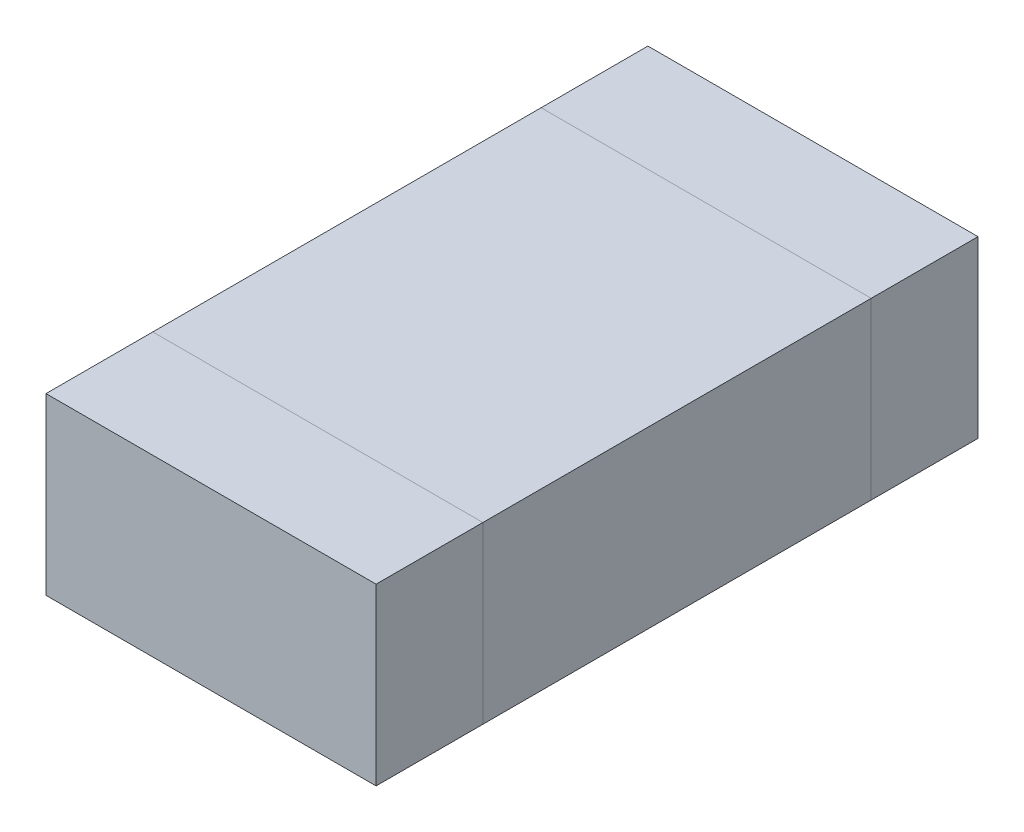
ISO-10303-21;
HEADER;
FILE_DESCRIPTION(('STEP AP214'),'2;1');
FILE_NAME('part.step','',(''),(''),'','','');
FILE_SCHEMA(('AUTOMOTIVE_DESIGN { 1 0 10303 214 1 1 1 1 }'));
ENDSEC;
DATA;
#1=APPLICATION_CONTEXT('core data for automotive mechanical design processes');
#2=APPLICATION_PROTOCOL_DEFINITION('international standard','automotive_design',2000,#1);
#3=PRODUCT_CONTEXT('',#1,'mechanical');
#4=PRODUCT('Part','Part','',(#3));
#5=PRODUCT_RELATED_PRODUCT_CATEGORY('part','',(#4));
#6=PRODUCT_DEFINITION_FORMATION('','',#4);
#7=PRODUCT_DEFINITION_CONTEXT('part definition',#1,'design');
#8=PRODUCT_DEFINITION('design','',#6,#7);
#9=PRODUCT_DEFINITION_SHAPE('','',#8);
#10=(LENGTH_UNIT() NAMED_UNIT(*) SI_UNIT(.MILLI.,.METRE.));
#11=(NAMED_UNIT(*) PLANE_ANGLE_UNIT() SI_UNIT($,.RADIAN.));
#12=(NAMED_UNIT(*) SI_UNIT($,.STERADIAN.) SOLID_ANGLE_UNIT());
#13=UNCERTAINTY_MEASURE_WITH_UNIT(LENGTH_MEASURE(1.E-05),#10,'distance_accuracy_value','');
#14=(GEOMETRIC_REPRESENTATION_CONTEXT(3) GLOBAL_UNCERTAINTY_ASSIGNED_CONTEXT((#13)) GLOBAL_UNIT_ASSIGNED_CONTEXT((#10,
#11,#12)) REPRESENTATION_CONTEXT('',''));
#15=CARTESIAN_POINT('',(0.,0.,0.));
#16=DIRECTION('',(0.,0.,1.));
#17=DIRECTION('',(1.,0.,0.));
#18=AXIS2_PLACEMENT_3D('',#15,#16,#17);
#19=CARTESIAN_POINT('',(0.,0.,0.));
#20=DIRECTION('',(0.,1.,0.));
#21=DIRECTION('',(0.,0.,1.));
#22=AXIS2_PLACEMENT_3D('',#19,#20,#21);
#23=PLANE('',#22);
#24=DIRECTION('',(-1.,0.,0.));
#25=VECTOR('',#24,1.);
#26=CARTESIAN_POINT('',(-0.425,0.,0.5));
#27=LINE('',#26,#25);
#28=CARTESIAN_POINT('',(0.425,0.,0.5));
#29=VERTEX_POINT('',#28);
#30=CARTESIAN_POINT('',(-0.425,0.,0.5));
#31=VERTEX_POINT('',#30);
#32=EDGE_CURVE('P0_E81',#29,#31,#27,.T.);
#33=ORIENTED_EDGE('',*,*,#32,.T.);
#34=DIRECTION('',(0.,0.,-1.));
#35=VECTOR('',#34,1.);
#36=CARTESIAN_POINT('',(-0.425,0.,-0.5));
#37=LINE('',#36,#35);
#38=CARTESIAN_POINT('',(-0.425,0.,-0.5));
#39=VERTEX_POINT('',#38);
#40=EDGE_CURVE('P0_E68',#31,#39,#37,.T.);
#41=ORIENTED_EDGE('',*,*,#40,.T.);
#42=DIRECTION('',(1.,0.,0.));
#43=VECTOR('',#42,1.);
#44=CARTESIAN_POINT('',(-0.425,0.,-0.5));
#45=LINE('',#44,#43);
#46=CARTESIAN_POINT('',(0.425,0.,-0.5));
#47=VERTEX_POINT('',#46);
#48=EDGE_CURVE('P0_E55',#39,#47,#45,.T.);
#49=ORIENTED_EDGE('',*,*,#48,.T.);
#50=DIRECTION('',(0.,0.,1.));
#51=VECTOR('',#50,1.);
#52=CARTESIAN_POINT('',(0.425,0.,-0.5));
#53=LINE('',#52,#51);
#54=EDGE_CURVE('P0_E20',#47,#29,#53,.T.);
#55=ORIENTED_EDGE('',*,*,#54,.T.);
#56=EDGE_LOOP('',(#33,#41,#49,#55));
#57=FACE_BOUND('',#56,.T.);
#58=ADVANCED_FACE('P0_F17',(#57),#23,.F.);
#59=CARTESIAN_POINT('',(0.425,0.45,-0.5));
#60=DIRECTION('',(-1.,0.,0.));
#61=DIRECTION('',(0.,0.,1.));
#62=AXIS2_PLACEMENT_3D('',#59,#60,#61);
#63=PLANE('',#62);
#64=DIRECTION('',(0.,1.,0.));
#65=VECTOR('',#64,1.);
#66=CARTESIAN_POINT('',(0.425,0.45,-0.5));
#67=LINE('',#66,#65);
#68=CARTESIAN_POINT('',(0.425,0.45,-0.5));
#69=VERTEX_POINT('',#68);
#70=EDGE_CURVE('P0_E61',#47,#69,#67,.T.);
#71=ORIENTED_EDGE('',*,*,#70,.T.);
#72=DIRECTION('',(0.,0.,1.));
#73=VECTOR('',#72,1.);
#74=CARTESIAN_POINT('',(0.425,0.45,0.));
#75=LINE('',#74,#73);
#76=CARTESIAN_POINT('',(0.425,0.45,0.5));
#77=VERTEX_POINT('',#76);
#78=EDGE_CURVE('P0_E83',#77,#69,#75,.F.);
#79=ORIENTED_EDGE('',*,*,#78,.F.);
#80=DIRECTION('',(0.,1.,0.));
#81=VECTOR('',#80,1.);
#82=CARTESIAN_POINT('',(0.425,0.45,0.5));
#83=LINE('',#82,#81);
#84=EDGE_CURVE('P0_E64',#77,#29,#83,.F.);
#85=ORIENTED_EDGE('',*,*,#84,.T.);
#86=ORIENTED_EDGE('',*,*,#54,.F.);
#87=EDGE_LOOP('',(#71,#79,#85,#86));
#88=FACE_BOUND('',#87,.T.);
#89=ADVANCED_FACE('P0_F60',(#88),#63,.F.);
#90=CARTESIAN_POINT('',(-0.425,0.45,-0.5));
#91=DIRECTION('',(0.,0.,1.));
#92=DIRECTION('',(1.,0.,0.));
#93=AXIS2_PLACEMENT_3D('',#90,#91,#92);
#94=PLANE('',#93);
#95=DIRECTION('',(0.,1.,0.));
#96=VECTOR('',#95,1.);
#97=CARTESIAN_POINT('',(-0.425,0.45,-0.5));
#98=LINE('',#97,#96);
#99=CARTESIAN_POINT('',(-0.425,0.45,-0.5));
#100=VERTEX_POINT('',#99);
#101=EDGE_CURVE('P0_E70',#39,#100,#98,.T.);
#102=ORIENTED_EDGE('',*,*,#101,.T.);
#103=DIRECTION('',(1.,0.,0.));
#104=VECTOR('',#103,1.);
#105=CARTESIAN_POINT('',(0.,0.45,-0.5));
#106=LINE('',#105,#104);
#107=EDGE_CURVE('P0_E74',#69,#100,#106,.F.);
#108=ORIENTED_EDGE('',*,*,#107,.F.);
#109=ORIENTED_EDGE('',*,*,#70,.F.);
#110=ORIENTED_EDGE('',*,*,#48,.F.);
#111=EDGE_LOOP('',(#102,#108,#109,#110));
#112=FACE_BOUND('',#111,.T.);
#113=ADVANCED_FACE('P0_F72',(#112),#94,.F.);
#114=CARTESIAN_POINT('',(-0.425,0.45,-0.5));
#115=DIRECTION('',(1.,0.,0.));
#116=DIRECTION('',(0.,0.,-1.));
#117=AXIS2_PLACEMENT_3D('',#114,#115,#116);
#118=PLANE('',#117);
#119=DIRECTION('',(0.,1.,0.));
#120=VECTOR('',#119,1.);
#121=CARTESIAN_POINT('',(-0.425,0.45,0.5));
#122=LINE('',#121,#120);
#123=CARTESIAN_POINT('',(-0.425,0.45,0.5));
#124=VERTEX_POINT('',#123);
#125=EDGE_CURVE('P0_E35',#31,#124,#122,.T.);
#126=ORIENTED_EDGE('',*,*,#125,.T.);
#127=DIRECTION('',(0.,0.,1.));
#128=VECTOR('',#127,1.);
#129=CARTESIAN_POINT('',(-0.425,0.45,0.));
#130=LINE('',#129,#128);
#131=EDGE_CURVE('P0_E26',#100,#124,#130,.T.);
#132=ORIENTED_EDGE('',*,*,#131,.F.);
#133=ORIENTED_EDGE('',*,*,#101,.F.);
#134=ORIENTED_EDGE('',*,*,#40,.F.);
#135=EDGE_LOOP('',(#126,#132,#133,#134));
#136=FACE_BOUND('',#135,.T.);
#137=ADVANCED_FACE('P0_F89',(#136),#118,.F.);
#138=CARTESIAN_POINT('',(-0.425,0.45,0.5));
#139=DIRECTION('',(0.,0.,-1.));
#140=DIRECTION('',(-1.,0.,0.));
#141=AXIS2_PLACEMENT_3D('',#138,#139,#140);
#142=PLANE('',#141);
#143=ORIENTED_EDGE('',*,*,#84,.F.);
#144=DIRECTION('',(1.,0.,0.));
#145=VECTOR('',#144,1.);
#146=CARTESIAN_POINT('',(0.,0.45,0.5));
#147=LINE('',#146,#145);
#148=EDGE_CURVE('P0_E11',#124,#77,#147,.T.);
#149=ORIENTED_EDGE('',*,*,#148,.F.);
#150=ORIENTED_EDGE('',*,*,#125,.F.);
#151=ORIENTED_EDGE('',*,*,#32,.F.);
#152=EDGE_LOOP('',(#143,#149,#150,#151));
#153=FACE_BOUND('',#152,.T.);
#154=ADVANCED_FACE('P0_F91',(#153),#142,.F.);
#155=CARTESIAN_POINT('',(0.,0.45,0.));
#156=DIRECTION('',(0.,1.,0.));
#157=DIRECTION('',(0.,0.,1.));
#158=AXIS2_PLACEMENT_3D('',#155,#156,#157);
#159=PLANE('',#158);
#160=ORIENTED_EDGE('',*,*,#131,.T.);
#161=ORIENTED_EDGE('',*,*,#148,.T.);
#162=ORIENTED_EDGE('',*,*,#78,.T.);
#163=ORIENTED_EDGE('',*,*,#107,.T.);
#164=EDGE_LOOP('',(#160,#161,#162,#163));
#165=FACE_BOUND('',#164,.T.);
#166=ADVANCED_FACE('P0_F88',(#165),#159,.T.);
#167=CLOSED_SHELL('',(#58,#89,#113,#137,#154,#166));
#168=MANIFOLD_SOLID_BREP('P0_B1',#167);
#169=CARTESIAN_POINT('',(-0.425,1.34337841926028,-0.5));
#170=DIRECTION('',(0.,0.,1.));
#171=DIRECTION('',(1.,0.,0.));
#172=AXIS2_PLACEMENT_3D('',#169,#170,#171);
#173=PLANE('',#172);
#174=DIRECTION('',(0.,1.,0.));
#175=VECTOR('',#174,1.);
#176=CARTESIAN_POINT('',(-0.425,1.34337841926028,-0.5));
#177=LINE('',#176,#175);
#178=CARTESIAN_POINT('',(-0.425,0.,-0.5));
#179=VERTEX_POINT('',#178);
#180=CARTESIAN_POINT('',(-0.425,0.45,-0.5));
#181=VERTEX_POINT('',#180);
#182=EDGE_CURVE('P1_E20',#179,#181,#177,.T.);
#183=ORIENTED_EDGE('',*,*,#182,.F.);
#184=DIRECTION('',(1.,0.,0.));
#185=VECTOR('',#184,1.);
#186=CARTESIAN_POINT('',(0.,0.,-0.5));
#187=LINE('',#186,#185);
#188=CARTESIAN_POINT('',(0.425,0.,-0.5));
#189=VERTEX_POINT('',#188);
#190=EDGE_CURVE('P1_E81',#189,#179,#187,.F.);
#191=ORIENTED_EDGE('',*,*,#190,.F.);
#192=DIRECTION('',(0.,1.,0.));
#193=VECTOR('',#192,1.);
#194=CARTESIAN_POINT('',(0.425,1.34337841926028,-0.5));
#195=LINE('',#194,#193);
#196=CARTESIAN_POINT('',(0.425,0.45,-0.5));
#197=VERTEX_POINT('',#196);
#198=EDGE_CURVE('P1_E68',#197,#189,#195,.F.);
#199=ORIENTED_EDGE('',*,*,#198,.F.);
#200=DIRECTION('',(1.,0.,0.));
#201=VECTOR('',#200,1.);
#202=CARTESIAN_POINT('',(0.,0.45,-0.5));
#203=LINE('',#202,#201);
#204=EDGE_CURVE('P1_E55',#181,#197,#203,.T.);
#205=ORIENTED_EDGE('',*,*,#204,.F.);
#206=EDGE_LOOP('',(#183,#191,#199,#205));
#207=FACE_BOUND('',#206,.T.);
#208=ADVANCED_FACE('P1_F17',(#207),#173,.T.);
#209=CARTESIAN_POINT('',(-0.425,1.34337841926028,-0.5));
#210=DIRECTION('',(-1.,0.,0.));
#211=DIRECTION('',(0.,0.,1.));
#212=AXIS2_PLACEMENT_3D('',#209,#210,#211);
#213=PLANE('',#212);
#214=DIRECTION('',(0.,1.,0.));
#215=VECTOR('',#214,1.);
#216=CARTESIAN_POINT('',(-0.425,1.34337841926028,-0.775));
#217=LINE('',#216,#215);
#218=CARTESIAN_POINT('',(-0.425,0.,-0.775));
#219=VERTEX_POINT('',#218);
#220=CARTESIAN_POINT('',(-0.425,0.45,-0.775));
#221=VERTEX_POINT('',#220);
#222=EDGE_CURVE('P1_E83',#219,#221,#217,.T.);
#223=ORIENTED_EDGE('',*,*,#222,.F.);
#224=DIRECTION('',(0.,0.,-1.));
#225=VECTOR('',#224,1.);
#226=CARTESIAN_POINT('',(-0.425,0.,0.));
#227=LINE('',#226,#225);
#228=EDGE_CURVE('P1_E64',#179,#219,#227,.T.);
#229=ORIENTED_EDGE('',*,*,#228,.F.);
#230=ORIENTED_EDGE('',*,*,#182,.T.);
#231=DIRECTION('',(0.,0.,1.));
#232=VECTOR('',#231,1.);
#233=CARTESIAN_POINT('',(-0.425,0.45,0.));
#234=LINE('',#233,#232);
#235=EDGE_CURVE('P1_E61',#221,#181,#234,.T.);
#236=ORIENTED_EDGE('',*,*,#235,.F.);
#237=EDGE_LOOP('',(#223,#229,#230,#236));
#238=FACE_BOUND('',#237,.T.);
#239=ADVANCED_FACE('P1_F60',(#238),#213,.T.);
#240=CARTESIAN_POINT('',(0.,0.45,0.));
#241=DIRECTION('',(0.,1.,0.));
#242=DIRECTION('',(0.,0.,1.));
#243=AXIS2_PLACEMENT_3D('',#240,#241,#242);
#244=PLANE('',#243);
#245=DIRECTION('',(0.,0.,-1.));
#246=VECTOR('',#245,1.);
#247=CARTESIAN_POINT('',(0.425,0.45,-0.5));
#248=LINE('',#247,#246);
#249=CARTESIAN_POINT('',(0.425,0.45,-0.775));
#250=VERTEX_POINT('',#249);
#251=EDGE_CURVE('P1_E70',#250,#197,#248,.F.);
#252=ORIENTED_EDGE('',*,*,#251,.F.);
#253=DIRECTION('',(-1.,0.,0.));
#254=VECTOR('',#253,1.);
#255=CARTESIAN_POINT('',(-0.425,0.45,-0.775));
#256=LINE('',#255,#254);
#257=EDGE_CURVE('P1_E74',#221,#250,#256,.F.);
#258=ORIENTED_EDGE('',*,*,#257,.F.);
#259=ORIENTED_EDGE('',*,*,#235,.T.);
#260=ORIENTED_EDGE('',*,*,#204,.T.);
#261=EDGE_LOOP('',(#252,#258,#259,#260));
#262=FACE_BOUND('',#261,.T.);
#263=ADVANCED_FACE('P1_F72',(#262),#244,.T.);
#264=CARTESIAN_POINT('',(0.425,1.34337841926028,-0.5));
#265=DIRECTION('',(1.,0.,0.));
#266=DIRECTION('',(0.,0.,-1.));
#267=AXIS2_PLACEMENT_3D('',#264,#265,#266);
#268=PLANE('',#267);
#269=ORIENTED_EDGE('',*,*,#198,.T.);
#270=DIRECTION('',(0.,0.,-1.));
#271=VECTOR('',#270,1.);
#272=CARTESIAN_POINT('',(0.425,0.,0.));
#273=LINE('',#272,#271);
#274=CARTESIAN_POINT('',(0.425,0.,-0.775));
#275=VERTEX_POINT('',#274);
#276=EDGE_CURVE('P1_E35',#275,#189,#273,.F.);
#277=ORIENTED_EDGE('',*,*,#276,.F.);
#278=DIRECTION('',(0.,1.,0.));
#279=VECTOR('',#278,1.);
#280=CARTESIAN_POINT('',(0.425,1.34337841926028,-0.775));
#281=LINE('',#280,#279);
#282=EDGE_CURVE('P1_E26',#250,#275,#281,.F.);
#283=ORIENTED_EDGE('',*,*,#282,.F.);
#284=ORIENTED_EDGE('',*,*,#251,.T.);
#285=EDGE_LOOP('',(#269,#277,#283,#284));
#286=FACE_BOUND('',#285,.T.);
#287=ADVANCED_FACE('P1_F89',(#286),#268,.T.);
#288=CARTESIAN_POINT('',(0.,0.,0.));
#289=DIRECTION('',(0.,-1.,0.));
#290=DIRECTION('',(0.,0.,-1.));
#291=AXIS2_PLACEMENT_3D('',#288,#289,#290);
#292=PLANE('',#291);
#293=ORIENTED_EDGE('',*,*,#276,.T.);
#294=ORIENTED_EDGE('',*,*,#190,.T.);
#295=ORIENTED_EDGE('',*,*,#228,.T.);
#296=DIRECTION('',(-1.,0.,0.));
#297=VECTOR('',#296,1.);
#298=CARTESIAN_POINT('',(-0.425,0.,-0.775));
#299=LINE('',#298,#297);
#300=EDGE_CURVE('P1_E11',#275,#219,#299,.T.);
#301=ORIENTED_EDGE('',*,*,#300,.F.);
#302=EDGE_LOOP('',(#293,#294,#295,#301));
#303=FACE_BOUND('',#302,.T.);
#304=ADVANCED_FACE('P1_F91',(#303),#292,.T.);
#305=CARTESIAN_POINT('',(-0.425,1.34337841926028,-0.775));
#306=DIRECTION('',(0.,0.,-1.));
#307=DIRECTION('',(-1.,0.,0.));
#308=AXIS2_PLACEMENT_3D('',#305,#306,#307);
#309=PLANE('',#308);
#310=ORIENTED_EDGE('',*,*,#282,.T.);
#311=ORIENTED_EDGE('',*,*,#300,.T.);
#312=ORIENTED_EDGE('',*,*,#222,.T.);
#313=ORIENTED_EDGE('',*,*,#257,.T.);
#314=EDGE_LOOP('',(#310,#311,#312,#313));
#315=FACE_BOUND('',#314,.T.);
#316=ADVANCED_FACE('P1_F88',(#315),#309,.T.);
#317=CLOSED_SHELL('',(#208,#239,#263,#287,#304,#316));
#318=MANIFOLD_SOLID_BREP('P1_B1',#317);
#319=CARTESIAN_POINT('',(-0.425,1.34337841926028,0.775));
#320=DIRECTION('',(0.,0.,1.));
#321=DIRECTION('',(1.,0.,0.));
#322=AXIS2_PLACEMENT_3D('',#319,#320,#321);
#323=PLANE('',#322);
#324=DIRECTION('',(0.,1.,0.));
#325=VECTOR('',#324,1.);
#326=CARTESIAN_POINT('',(-0.425,1.34337841926028,0.775));
#327=LINE('',#326,#325);
#328=CARTESIAN_POINT('',(-0.425,0.,0.775));
#329=VERTEX_POINT('',#328);
#330=CARTESIAN_POINT('',(-0.425,0.45,0.775));
#331=VERTEX_POINT('',#330);
#332=EDGE_CURVE('P2_E20',#329,#331,#327,.T.);
#333=ORIENTED_EDGE('',*,*,#332,.F.);
#334=DIRECTION('',(1.,0.,0.));
#335=VECTOR('',#334,1.);
#336=CARTESIAN_POINT('',(0.,0.,0.775));
#337=LINE('',#336,#335);
#338=CARTESIAN_POINT('',(0.425,0.,0.775));
#339=VERTEX_POINT('',#338);
#340=EDGE_CURVE('P2_E79',#329,#339,#337,.T.);
#341=ORIENTED_EDGE('',*,*,#340,.T.);
#342=DIRECTION('',(0.,1.,0.));
#343=VECTOR('',#342,1.);
#344=CARTESIAN_POINT('',(0.425,1.34337841926028,0.775));
#345=LINE('',#344,#343);
#346=CARTESIAN_POINT('',(0.425,0.45,0.775));
#347=VERTEX_POINT('',#346);
#348=EDGE_CURVE('P2_E68',#347,#339,#345,.F.);
#349=ORIENTED_EDGE('',*,*,#348,.F.);
#350=DIRECTION('',(1.,0.,0.));
#351=VECTOR('',#350,1.);
#352=CARTESIAN_POINT('',(0.,0.45,0.775));
#353=LINE('',#352,#351);
#354=EDGE_CURVE('P2_E56',#331,#347,#353,.T.);
#355=ORIENTED_EDGE('',*,*,#354,.F.);
#356=EDGE_LOOP('',(#333,#341,#349,#355));
#357=FACE_BOUND('',#356,.T.);
#358=ADVANCED_FACE('P2_F17',(#357),#323,.T.);
#359=CARTESIAN_POINT('',(-0.425,1.34337841926028,0.5));
#360=DIRECTION('',(-1.,0.,0.));
#361=DIRECTION('',(0.,0.,1.));
#362=AXIS2_PLACEMENT_3D('',#359,#360,#361);
#363=PLANE('',#362);
#364=DIRECTION('',(0.,1.,0.));
#365=VECTOR('',#364,1.);
#366=CARTESIAN_POINT('',(-0.425,1.34337841926028,0.5));
#367=LINE('',#366,#365);
#368=CARTESIAN_POINT('',(-0.425,0.,0.5));
#369=VERTEX_POINT('',#368);
#370=CARTESIAN_POINT('',(-0.425,0.45,0.5));
#371=VERTEX_POINT('',#370);
#372=EDGE_CURVE('P2_E83',#369,#371,#367,.T.);
#373=ORIENTED_EDGE('',*,*,#372,.F.);
#374=DIRECTION('',(0.,0.,1.));
#375=VECTOR('',#374,1.);
#376=CARTESIAN_POINT('',(-0.425,0.,0.));
#377=LINE('',#376,#375);
#378=EDGE_CURVE('P2_E65',#369,#329,#377,.T.);
#379=ORIENTED_EDGE('',*,*,#378,.T.);
#380=ORIENTED_EDGE('',*,*,#332,.T.);
#381=DIRECTION('',(0.,0.,1.));
#382=VECTOR('',#381,1.);
#383=CARTESIAN_POINT('',(-0.425,0.45,0.));
#384=LINE('',#383,#382);
#385=EDGE_CURVE('P2_E62',#371,#331,#384,.T.);
#386=ORIENTED_EDGE('',*,*,#385,.F.);
#387=EDGE_LOOP('',(#373,#379,#380,#386));
#388=FACE_BOUND('',#387,.T.);
#389=ADVANCED_FACE('P2_F61',(#388),#363,.T.);
#390=CARTESIAN_POINT('',(0.,0.45,0.));
#391=DIRECTION('',(0.,1.,0.));
#392=DIRECTION('',(0.,0.,1.));
#393=AXIS2_PLACEMENT_3D('',#390,#391,#392);
#394=PLANE('',#393);
#395=DIRECTION('',(0.,0.,-1.));
#396=VECTOR('',#395,1.);
#397=CARTESIAN_POINT('',(0.425,0.45,0.5));
#398=LINE('',#397,#396);
#399=CARTESIAN_POINT('',(0.425,0.45,0.5));
#400=VERTEX_POINT('',#399);
#401=EDGE_CURVE('P2_E70',#400,#347,#398,.F.);
#402=ORIENTED_EDGE('',*,*,#401,.F.);
#403=DIRECTION('',(-1.,0.,0.));
#404=VECTOR('',#403,1.);
#405=CARTESIAN_POINT('',(-0.425,0.45,0.5));
#406=LINE('',#405,#404);
#407=EDGE_CURVE('P2_E74',#371,#400,#406,.F.);
#408=ORIENTED_EDGE('',*,*,#407,.F.);
#409=ORIENTED_EDGE('',*,*,#385,.T.);
#410=ORIENTED_EDGE('',*,*,#354,.T.);
#411=EDGE_LOOP('',(#402,#408,#409,#410));
#412=FACE_BOUND('',#411,.T.);
#413=ADVANCED_FACE('P2_F72',(#412),#394,.T.);
#414=CARTESIAN_POINT('',(0.425,1.34337841926028,0.5));
#415=DIRECTION('',(1.,0.,0.));
#416=DIRECTION('',(0.,0.,-1.));
#417=AXIS2_PLACEMENT_3D('',#414,#415,#416);
#418=PLANE('',#417);
#419=ORIENTED_EDGE('',*,*,#348,.T.);
#420=DIRECTION('',(0.,0.,1.));
#421=VECTOR('',#420,1.);
#422=CARTESIAN_POINT('',(0.425,0.,0.));
#423=LINE('',#422,#421);
#424=CARTESIAN_POINT('',(0.425,0.,0.5));
#425=VERTEX_POINT('',#424);
#426=EDGE_CURVE('P2_E35',#339,#425,#423,.F.);
#427=ORIENTED_EDGE('',*,*,#426,.T.);
#428=DIRECTION('',(0.,1.,0.));
#429=VECTOR('',#428,1.);
#430=CARTESIAN_POINT('',(0.425,1.34337841926028,0.5));
#431=LINE('',#430,#429);
#432=EDGE_CURVE('P2_E26',#400,#425,#431,.F.);
#433=ORIENTED_EDGE('',*,*,#432,.F.);
#434=ORIENTED_EDGE('',*,*,#401,.T.);
#435=EDGE_LOOP('',(#419,#427,#433,#434));
#436=FACE_BOUND('',#435,.T.);
#437=ADVANCED_FACE('P2_F89',(#436),#418,.T.);
#438=CARTESIAN_POINT('',(0.,0.,0.));
#439=DIRECTION('',(0.,1.,0.));
#440=DIRECTION('',(0.,0.,1.));
#441=AXIS2_PLACEMENT_3D('',#438,#439,#440);
#442=PLANE('',#441);
#443=DIRECTION('',(-1.,0.,0.));
#444=VECTOR('',#443,1.);
#445=CARTESIAN_POINT('',(-0.425,0.,0.5));
#446=LINE('',#445,#444);
#447=EDGE_CURVE('P2_E11',#425,#369,#446,.T.);
#448=ORIENTED_EDGE('',*,*,#447,.F.);
#449=ORIENTED_EDGE('',*,*,#426,.F.);
#450=ORIENTED_EDGE('',*,*,#340,.F.);
#451=ORIENTED_EDGE('',*,*,#378,.F.);
#452=EDGE_LOOP('',(#448,#449,#450,#451));
#453=FACE_BOUND('',#452,.T.);
#454=ADVANCED_FACE('P2_F91',(#453),#442,.F.);
#455=CARTESIAN_POINT('',(-0.425,1.34337841926028,0.5));
#456=DIRECTION('',(0.,0.,-1.));
#457=DIRECTION('',(-1.,0.,0.));
#458=AXIS2_PLACEMENT_3D('',#455,#456,#457);
#459=PLANE('',#458);
#460=ORIENTED_EDGE('',*,*,#432,.T.);
#461=ORIENTED_EDGE('',*,*,#447,.T.);
#462=ORIENTED_EDGE('',*,*,#372,.T.);
#463=ORIENTED_EDGE('',*,*,#407,.T.);
#464=EDGE_LOOP('',(#460,#461,#462,#463));
#465=FACE_BOUND('',#464,.T.);
#466=ADVANCED_FACE('P2_F88',(#465),#459,.T.);
#467=CLOSED_SHELL('',(#358,#389,#413,#437,#454,#466));
#468=MANIFOLD_SOLID_BREP('P2_B1',#467);
#469=ADVANCED_BREP_SHAPE_REPRESENTATION('',(#18,#168,#318,#468),#14);
#470=SHAPE_DEFINITION_REPRESENTATION(#9,#469);
ENDSEC;
END-ISO-10303-21;
